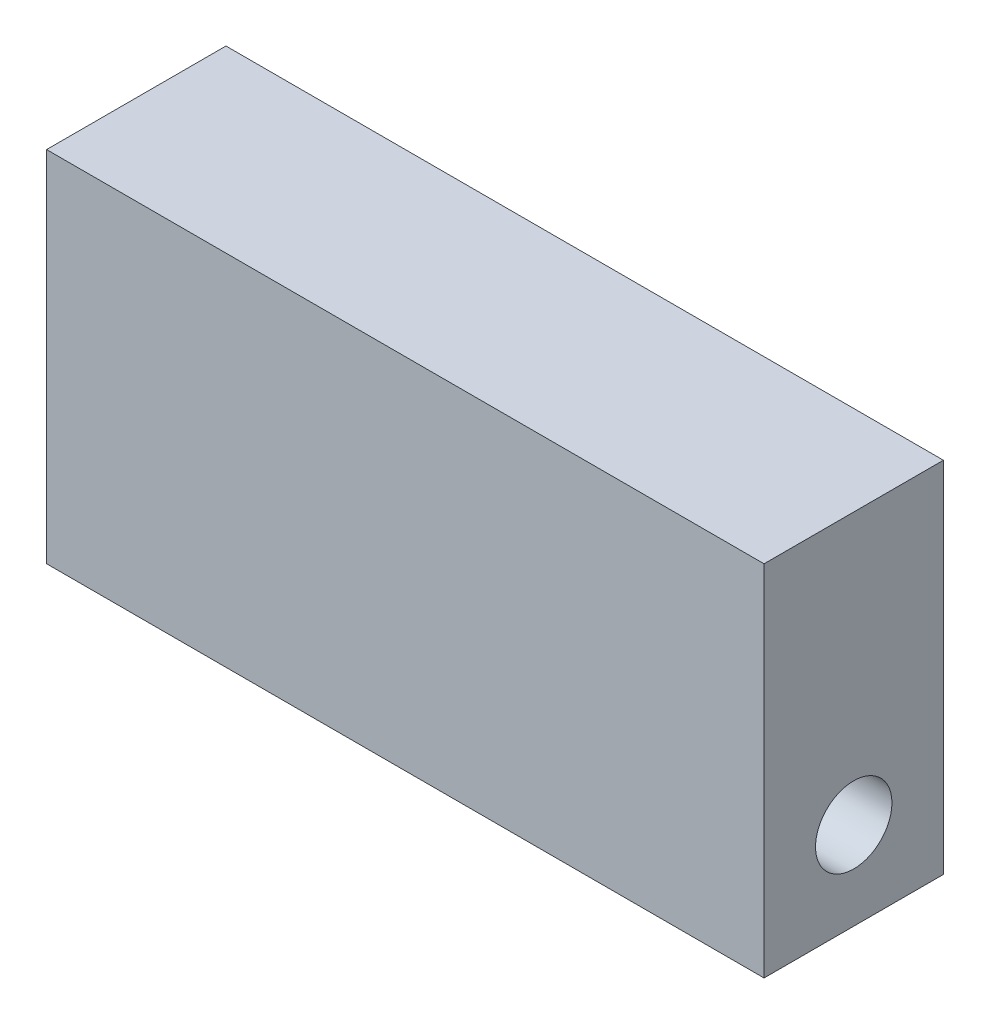
ISO-10303-21;
HEADER;
FILE_DESCRIPTION(('STEP AP214'),'2;1');
FILE_NAME('part.step','',(''),(''),'','','');
FILE_SCHEMA(('AUTOMOTIVE_DESIGN { 1 0 10303 214 1 1 1 1 }'));
ENDSEC;
DATA;
#1=APPLICATION_CONTEXT('core data for automotive mechanical design processes');
#2=APPLICATION_PROTOCOL_DEFINITION('international standard','automotive_design',2000,#1);
#3=PRODUCT_CONTEXT('',#1,'mechanical');
#4=PRODUCT('Part','Part','',(#3));
#5=PRODUCT_RELATED_PRODUCT_CATEGORY('part','',(#4));
#6=PRODUCT_DEFINITION_FORMATION('','',#4);
#7=PRODUCT_DEFINITION_CONTEXT('part definition',#1,'design');
#8=PRODUCT_DEFINITION('design','',#6,#7);
#9=PRODUCT_DEFINITION_SHAPE('','',#8);
#10=(LENGTH_UNIT() NAMED_UNIT(*) SI_UNIT(.MILLI.,.METRE.));
#11=(NAMED_UNIT(*) PLANE_ANGLE_UNIT() SI_UNIT($,.RADIAN.));
#12=(NAMED_UNIT(*) SI_UNIT($,.STERADIAN.) SOLID_ANGLE_UNIT());
#13=UNCERTAINTY_MEASURE_WITH_UNIT(LENGTH_MEASURE(1.E-05),#10,'distance_accuracy_value','');
#14=(GEOMETRIC_REPRESENTATION_CONTEXT(3) GLOBAL_UNCERTAINTY_ASSIGNED_CONTEXT((#13)) GLOBAL_UNIT_ASSIGNED_CONTEXT((#10,
#11,#12)) REPRESENTATION_CONTEXT('',''));
#15=CARTESIAN_POINT('',(0.,0.,0.));
#16=DIRECTION('',(0.,0.,1.));
#17=DIRECTION('',(1.,0.,0.));
#18=AXIS2_PLACEMENT_3D('',#15,#16,#17);
#19=CARTESIAN_POINT('',(25.4,25.4,6.35));
#20=DIRECTION('',(-1.,0.,0.));
#21=DIRECTION('',(0.,0.,1.));
#22=AXIS2_PLACEMENT_3D('',#19,#20,#21);
#23=PLANE('',#22);
#24=CARTESIAN_POINT('',(25.4,6.21519817667604,0.));
#25=DIRECTION('',(1.,0.,0.));
#26=DIRECTION('',(0.,0.,-1.));
#27=AXIS2_PLACEMENT_3D('',#24,#25,#26);
#28=CIRCLE('',#27,2.70509999999999);
#29=CARTESIAN_POINT('',(25.4,6.21519817667604,-2.70509999999999));
#30=VERTEX_POINT('',#29);
#31=EDGE_CURVE('E111',#30,#30,#28,.T.);
#32=ORIENTED_EDGE('',*,*,#31,.F.);
#33=EDGE_LOOP('',(#32));
#34=FACE_BOUND('',#33,.T.);
#35=DIRECTION('',(0.,0.,-1.));
#36=VECTOR('',#35,1.);
#37=CARTESIAN_POINT('',(25.4,0.,6.35));
#38=LINE('',#37,#36);
#39=CARTESIAN_POINT('',(25.4,0.,6.35));
#40=VERTEX_POINT('',#39);
#41=CARTESIAN_POINT('',(25.4,0.,-6.35));
#42=VERTEX_POINT('',#41);
#43=EDGE_CURVE('E110',#40,#42,#38,.T.);
#44=ORIENTED_EDGE('',*,*,#43,.T.);
#45=DIRECTION('',(0.,-1.,0.));
#46=VECTOR('',#45,1.);
#47=CARTESIAN_POINT('',(25.4,25.4,-6.35));
#48=LINE('',#47,#46);
#49=CARTESIAN_POINT('',(25.4,25.4,-6.35));
#50=VERTEX_POINT('',#49);
#51=EDGE_CURVE('E13',#50,#42,#48,.T.);
#52=ORIENTED_EDGE('',*,*,#51,.F.);
#53=DIRECTION('',(0.,0.,-1.));
#54=VECTOR('',#53,1.);
#55=CARTESIAN_POINT('',(25.4,25.4,6.35));
#56=LINE('',#55,#54);
#57=CARTESIAN_POINT('',(25.4,25.4,6.35));
#58=VERTEX_POINT('',#57);
#59=EDGE_CURVE('E119',#58,#50,#56,.T.);
#60=ORIENTED_EDGE('',*,*,#59,.F.);
#61=DIRECTION('',(0.,-1.,0.));
#62=VECTOR('',#61,1.);
#63=CARTESIAN_POINT('',(25.4,25.4,6.35));
#64=LINE('',#63,#62);
#65=EDGE_CURVE('E124',#58,#40,#64,.T.);
#66=ORIENTED_EDGE('',*,*,#65,.T.);
#67=EDGE_LOOP('',(#44,#52,#60,#66));
#68=FACE_BOUND('',#67,.T.);
#69=ADVANCED_FACE('F49',(#34,#68),#23,.F.);
#70=CARTESIAN_POINT('',(-25.4,25.4,-6.35));
#71=DIRECTION('',(0.,0.,1.));
#72=DIRECTION('',(1.,0.,0.));
#73=AXIS2_PLACEMENT_3D('',#70,#71,#72);
#74=PLANE('',#73);
#75=DIRECTION('',(-1.,0.,0.));
#76=VECTOR('',#75,1.);
#77=CARTESIAN_POINT('',(-25.4,0.,-6.35));
#78=LINE('',#77,#76);
#79=CARTESIAN_POINT('',(-25.4,0.,-6.35));
#80=VERTEX_POINT('',#79);
#81=EDGE_CURVE('E114',#42,#80,#78,.T.);
#82=ORIENTED_EDGE('',*,*,#81,.T.);
#83=DIRECTION('',(0.,-1.,0.));
#84=VECTOR('',#83,1.);
#85=CARTESIAN_POINT('',(-25.4,25.4,-6.35));
#86=LINE('',#85,#84);
#87=CARTESIAN_POINT('',(-25.4,25.4,-6.35));
#88=VERTEX_POINT('',#87);
#89=EDGE_CURVE('E57',#88,#80,#86,.T.);
#90=ORIENTED_EDGE('',*,*,#89,.F.);
#91=DIRECTION('',(-1.,0.,0.));
#92=VECTOR('',#91,1.);
#93=CARTESIAN_POINT('',(-25.4,25.4,-6.35));
#94=LINE('',#93,#92);
#95=EDGE_CURVE('E96',#50,#88,#94,.T.);
#96=ORIENTED_EDGE('',*,*,#95,.F.);
#97=ORIENTED_EDGE('',*,*,#51,.T.);
#98=EDGE_LOOP('',(#82,#90,#96,#97));
#99=FACE_BOUND('',#98,.T.);
#100=ADVANCED_FACE('F147',(#99),#74,.F.);
#101=CARTESIAN_POINT('',(-25.4,25.4,6.35));
#102=DIRECTION('',(1.,0.,0.));
#103=DIRECTION('',(0.,0.,-1.));
#104=AXIS2_PLACEMENT_3D('',#101,#102,#103);
#105=PLANE('',#104);
#106=DIRECTION('',(0.,0.,1.));
#107=VECTOR('',#106,1.);
#108=CARTESIAN_POINT('',(-25.4,0.,6.35));
#109=LINE('',#108,#107);
#110=CARTESIAN_POINT('',(-25.4,0.,6.35));
#111=VERTEX_POINT('',#110);
#112=EDGE_CURVE('E83',#80,#111,#109,.T.);
#113=ORIENTED_EDGE('',*,*,#112,.T.);
#114=DIRECTION('',(0.,-1.,0.));
#115=VECTOR('',#114,1.);
#116=CARTESIAN_POINT('',(-25.4,25.4,6.35));
#117=LINE('',#116,#115);
#118=CARTESIAN_POINT('',(-25.4,25.4,6.35));
#119=VERTEX_POINT('',#118);
#120=EDGE_CURVE('E130',#119,#111,#117,.T.);
#121=ORIENTED_EDGE('',*,*,#120,.F.);
#122=DIRECTION('',(0.,0.,1.));
#123=VECTOR('',#122,1.);
#124=CARTESIAN_POINT('',(-25.4,25.4,6.35));
#125=LINE('',#124,#123);
#126=EDGE_CURVE('E122',#88,#119,#125,.T.);
#127=ORIENTED_EDGE('',*,*,#126,.F.);
#128=ORIENTED_EDGE('',*,*,#89,.T.);
#129=EDGE_LOOP('',(#113,#121,#127,#128));
#130=FACE_BOUND('',#129,.T.);
#131=ADVANCED_FACE('F132',(#130),#105,.F.);
#132=CARTESIAN_POINT('',(-25.4,25.4,6.35));
#133=DIRECTION('',(0.,0.,-1.));
#134=DIRECTION('',(-1.,0.,0.));
#135=AXIS2_PLACEMENT_3D('',#132,#133,#134);
#136=PLANE('',#135);
#137=DIRECTION('',(1.,0.,0.));
#138=VECTOR('',#137,1.);
#139=CARTESIAN_POINT('',(-25.4,0.,6.35));
#140=LINE('',#139,#138);
#141=EDGE_CURVE('E89',#111,#40,#140,.T.);
#142=ORIENTED_EDGE('',*,*,#141,.T.);
#143=ORIENTED_EDGE('',*,*,#65,.F.);
#144=DIRECTION('',(1.,0.,0.));
#145=VECTOR('',#144,1.);
#146=CARTESIAN_POINT('',(-25.4,25.4,6.35));
#147=LINE('',#146,#145);
#148=EDGE_CURVE('E65',#119,#58,#147,.T.);
#149=ORIENTED_EDGE('',*,*,#148,.F.);
#150=ORIENTED_EDGE('',*,*,#120,.T.);
#151=EDGE_LOOP('',(#142,#143,#149,#150));
#152=FACE_BOUND('',#151,.T.);
#153=ADVANCED_FACE('F138',(#152),#136,.F.);
#154=CARTESIAN_POINT('',(0.,25.4,0.));
#155=DIRECTION('',(0.,-1.,0.));
#156=DIRECTION('',(0.,0.,-1.));
#157=AXIS2_PLACEMENT_3D('',#154,#155,#156);
#158=PLANE('',#157);
#159=ORIENTED_EDGE('',*,*,#59,.T.);
#160=ORIENTED_EDGE('',*,*,#95,.T.);
#161=ORIENTED_EDGE('',*,*,#126,.T.);
#162=ORIENTED_EDGE('',*,*,#148,.T.);
#163=EDGE_LOOP('',(#159,#160,#161,#162));
#164=FACE_BOUND('',#163,.T.);
#165=ADVANCED_FACE('F140',(#164),#158,.F.);
#166=CARTESIAN_POINT('',(0.,0.,0.));
#167=DIRECTION('',(0.,-1.,0.));
#168=DIRECTION('',(0.,0.,-1.));
#169=AXIS2_PLACEMENT_3D('',#166,#167,#168);
#170=PLANE('',#169);
#171=ORIENTED_EDGE('',*,*,#43,.F.);
#172=ORIENTED_EDGE('',*,*,#141,.F.);
#173=ORIENTED_EDGE('',*,*,#112,.F.);
#174=ORIENTED_EDGE('',*,*,#81,.F.);
#175=EDGE_LOOP('',(#171,#172,#173,#174));
#176=FACE_BOUND('',#175,.T.);
#177=ADVANCED_FACE('F104',(#176),#170,.T.);
#178=CARTESIAN_POINT('',(-4.572,6.21519817667604,0.));
#179=DIRECTION('',(1.,0.,0.));
#180=DIRECTION('',(0.,0.,-1.));
#181=AXIS2_PLACEMENT_3D('',#178,#179,#180);
#182=CONICAL_SURFACE('',#181,2.70509999999999,1.02974425867665);
#183=CARTESIAN_POINT('',(-6.19738806053146,6.21519817667603,0.));
#184=VERTEX_POINT('',#183);
#185=VERTEX_LOOP('',#184);
#186=FACE_BOUND('',#185,.T.);
#187=CARTESIAN_POINT('',(-4.572,6.21519817667604,0.));
#188=DIRECTION('',(1.,0.,0.));
#189=DIRECTION('',(0.,0.,-1.));
#190=AXIS2_PLACEMENT_3D('',#187,#188,#189);
#191=CIRCLE('',#190,2.70509999999999);
#192=CARTESIAN_POINT('',(-4.572,6.21519817667604,-2.70509999999999));
#193=VERTEX_POINT('',#192);
#194=EDGE_CURVE('E108',#193,#193,#191,.T.);
#195=ORIENTED_EDGE('',*,*,#194,.T.);
#196=EDGE_LOOP('',(#195));
#197=FACE_BOUND('',#196,.T.);
#198=ADVANCED_FACE('F100',(#186,#197),#182,.F.);
#199=CARTESIAN_POINT('',(25.4,6.21519817667604,0.));
#200=DIRECTION('',(1.,0.,0.));
#201=DIRECTION('',(0.,0.,-1.));
#202=AXIS2_PLACEMENT_3D('',#199,#200,#201);
#203=CYLINDRICAL_SURFACE('',#202,2.70509999999999);
#204=ORIENTED_EDGE('',*,*,#194,.F.);
#205=EDGE_LOOP('',(#204));
#206=FACE_BOUND('',#205,.T.);
#207=ORIENTED_EDGE('',*,*,#31,.T.);
#208=EDGE_LOOP('',(#207));
#209=FACE_BOUND('',#208,.T.);
#210=ADVANCED_FACE('F103',(#206,#209),#203,.F.);
#211=CLOSED_SHELL('',(#69,#100,#131,#153,#165,#177,#198,#210));
#212=MANIFOLD_SOLID_BREP('B2',#211);
#213=ADVANCED_BREP_SHAPE_REPRESENTATION('',(#18,#212),#14);
#214=SHAPE_DEFINITION_REPRESENTATION(#9,#213);
ENDSEC;
END-ISO-10303-21;
